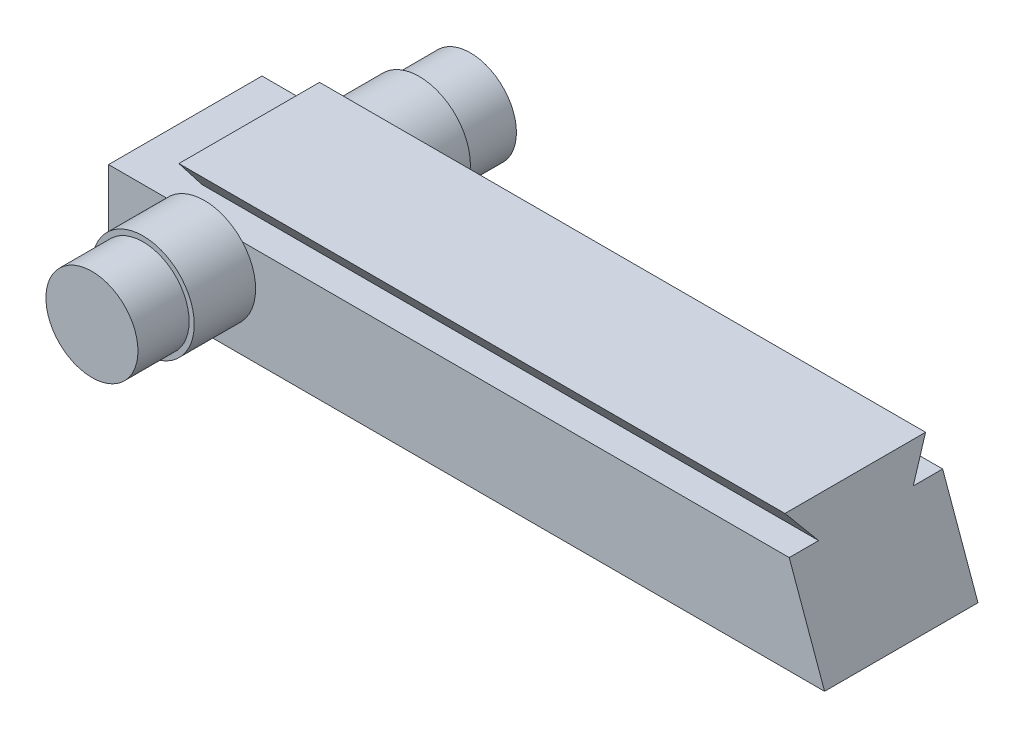
ISO-10303-21;
HEADER;
FILE_DESCRIPTION(('STEP AP214'),'2;1');
FILE_NAME('part.step','',(''),(''),'','','');
FILE_SCHEMA(('AUTOMOTIVE_DESIGN { 1 0 10303 214 1 1 1 1 }'));
ENDSEC;
DATA;
#1=APPLICATION_CONTEXT('core data for automotive mechanical design processes');
#2=APPLICATION_PROTOCOL_DEFINITION('international standard','automotive_design',2000,#1);
#3=PRODUCT_CONTEXT('',#1,'mechanical');
#4=PRODUCT('Part','Part','',(#3));
#5=PRODUCT_RELATED_PRODUCT_CATEGORY('part','',(#4));
#6=PRODUCT_DEFINITION_FORMATION('','',#4);
#7=PRODUCT_DEFINITION_CONTEXT('part definition',#1,'design');
#8=PRODUCT_DEFINITION('design','',#6,#7);
#9=PRODUCT_DEFINITION_SHAPE('','',#8);
#10=(LENGTH_UNIT() NAMED_UNIT(*) SI_UNIT(.MILLI.,.METRE.));
#11=(NAMED_UNIT(*) PLANE_ANGLE_UNIT() SI_UNIT($,.RADIAN.));
#12=(NAMED_UNIT(*) SI_UNIT($,.STERADIAN.) SOLID_ANGLE_UNIT());
#13=UNCERTAINTY_MEASURE_WITH_UNIT(LENGTH_MEASURE(1.E-05),#10,'distance_accuracy_value','');
#14=(GEOMETRIC_REPRESENTATION_CONTEXT(3) GLOBAL_UNCERTAINTY_ASSIGNED_CONTEXT((#13)) GLOBAL_UNIT_ASSIGNED_CONTEXT((#10,
#11,#12)) REPRESENTATION_CONTEXT('',''));
#15=CARTESIAN_POINT('',(0.,0.,0.));
#16=DIRECTION('',(0.,0.,1.));
#17=DIRECTION('',(1.,0.,0.));
#18=AXIS2_PLACEMENT_3D('',#15,#16,#17);
#19=CARTESIAN_POINT('',(-13.0175,0.7366,6.85800000000001));
#20=DIRECTION('',(0.,0.,1.));
#21=DIRECTION('',(1.,0.,0.));
#22=AXIS2_PLACEMENT_3D('',#19,#20,#21);
#23=PLANE('',#22);
#24=CARTESIAN_POINT('',(-13.0175,0.7366,6.85800000000001));
#25=DIRECTION('',(0.,0.,1.));
#26=DIRECTION('',(1.,0.,0.));
#27=AXIS2_PLACEMENT_3D('',#24,#25,#26);
#28=CIRCLE('',#27,2.54);
#29=CARTESIAN_POINT('',(-10.4775,0.7366,6.85800000000001));
#30=VERTEX_POINT('',#29);
#31=EDGE_CURVE('E209',#30,#30,#28,.T.);
#32=ORIENTED_EDGE('',*,*,#31,.T.);
#33=EDGE_LOOP('',(#32));
#34=FACE_BOUND('',#33,.T.);
#35=CARTESIAN_POINT('',(-13.0175,0.7366,6.85800000000001));
#36=DIRECTION('',(0.,0.,1.));
#37=DIRECTION('',(1.,0.,0.));
#38=AXIS2_PLACEMENT_3D('',#35,#36,#37);
#39=CIRCLE('',#38,2.286);
#40=CARTESIAN_POINT('',(-10.7315,0.7366,6.85800000000001));
#41=VERTEX_POINT('',#40);
#42=EDGE_CURVE('E218',#41,#41,#39,.T.);
#43=ORIENTED_EDGE('',*,*,#42,.F.);
#44=EDGE_LOOP('',(#43));
#45=FACE_BOUND('',#44,.T.);
#46=ADVANCED_FACE('F32',(#34,#45),#23,.T.);
#47=CARTESIAN_POINT('',(17.78,-2.4384,3.81000000000001));
#48=DIRECTION('',(0.,0.,-1.));
#49=DIRECTION('',(-1.,0.,0.));
#50=AXIS2_PLACEMENT_3D('',#47,#48,#49);
#51=PLANE('',#50);
#52=CARTESIAN_POINT('',(-13.0175,0.7366,3.81000000000001));
#53=DIRECTION('',(0.,0.,1.));
#54=DIRECTION('',(1.,0.,0.));
#55=AXIS2_PLACEMENT_3D('',#52,#53,#54);
#56=CIRCLE('',#55,2.54);
#57=CARTESIAN_POINT('',(-14.9030971892215,2.4384,3.81000000000001));
#58=VERTEX_POINT('',#57);
#59=CARTESIAN_POINT('',(-11.1319028107785,2.4384,3.81000000000001));
#60=VERTEX_POINT('',#59);
#61=EDGE_CURVE('E54',#58,#60,#56,.T.);
#62=ORIENTED_EDGE('',*,*,#61,.F.);
#63=DIRECTION('',(-1.,0.,0.));
#64=VECTOR('',#63,1.);
#65=CARTESIAN_POINT('',(17.78,2.4384,3.81000000000001));
#66=LINE('',#65,#64);
#67=CARTESIAN_POINT('',(-17.78,2.4384,3.81000000000001));
#68=VERTEX_POINT('',#67);
#69=EDGE_CURVE('E158',#58,#68,#66,.T.);
#70=ORIENTED_EDGE('',*,*,#69,.T.);
#71=DIRECTION('',(0.,-1.,0.));
#72=VECTOR('',#71,1.);
#73=CARTESIAN_POINT('',(-17.78,-2.4384,3.81000000000001));
#74=LINE('',#73,#72);
#75=CARTESIAN_POINT('',(-17.78,-2.4384,3.81000000000001));
#76=VERTEX_POINT('',#75);
#77=EDGE_CURVE('E152',#68,#76,#74,.T.);
#78=ORIENTED_EDGE('',*,*,#77,.T.);
#79=DIRECTION('',(-1.,0.,0.));
#80=VECTOR('',#79,1.);
#81=CARTESIAN_POINT('',(17.78,-2.4384,3.81000000000001));
#82=LINE('',#81,#80);
#83=CARTESIAN_POINT('',(17.78,-2.4384,3.81000000000001));
#84=VERTEX_POINT('',#83);
#85=EDGE_CURVE('E156',#84,#76,#82,.T.);
#86=ORIENTED_EDGE('',*,*,#85,.F.);
#87=DIRECTION('',(0.338719468272742,-0.940887411868727,0.));
#88=VECTOR('',#87,1.);
#89=CARTESIAN_POINT('',(17.78,-2.4384,3.81000000000001));
#90=LINE('',#89,#88);
#91=CARTESIAN_POINT('',(16.024352,2.4384,3.81000000000001));
#92=VERTEX_POINT('',#91);
#93=EDGE_CURVE('E207',#92,#84,#90,.T.);
#94=ORIENTED_EDGE('',*,*,#93,.F.);
#95=EDGE_CURVE('E127',#92,#60,#66,.T.);
#96=ORIENTED_EDGE('',*,*,#95,.T.);
#97=EDGE_LOOP('',(#62,#70,#78,#86,#94,#96));
#98=FACE_BOUND('',#97,.T.);
#99=ADVANCED_FACE('F239',(#98),#51,.F.);
#100=CARTESIAN_POINT('',(17.78,2.4384,3.81000000000001));
#101=DIRECTION('',(0.,-1.,0.));
#102=DIRECTION('',(0.,0.,-1.));
#103=AXIS2_PLACEMENT_3D('',#100,#101,#102);
#104=PLANE('',#103);
#105=ORIENTED_EDGE('',*,*,#95,.F.);
#106=DIRECTION('',(0.,0.,-1.));
#107=VECTOR('',#106,1.);
#108=CARTESIAN_POINT('',(16.024352,2.4384,3.81000000000001));
#109=LINE('',#108,#107);
#110=CARTESIAN_POINT('',(16.024352,2.4384,2.3495));
#111=VERTEX_POINT('',#110);
#112=EDGE_CURVE('E186',#92,#111,#109,.T.);
#113=ORIENTED_EDGE('',*,*,#112,.T.);
#114=DIRECTION('',(1.,0.,0.));
#115=VECTOR('',#114,1.);
#116=CARTESIAN_POINT('',(-14.605,2.4384,2.3495));
#117=LINE('',#116,#115);
#118=CARTESIAN_POINT('',(-14.605,2.4384,2.3495));
#119=VERTEX_POINT('',#118);
#120=EDGE_CURVE('E142',#119,#111,#117,.T.);
#121=ORIENTED_EDGE('',*,*,#120,.F.);
#122=DIRECTION('',(0.,0.,-1.));
#123=VECTOR('',#122,1.);
#124=CARTESIAN_POINT('',(-14.605,2.4384,2.3495));
#125=LINE('',#124,#123);
#126=CARTESIAN_POINT('',(-14.605,2.4384,-2.3495));
#127=VERTEX_POINT('',#126);
#128=EDGE_CURVE('E185',#119,#127,#125,.T.);
#129=ORIENTED_EDGE('',*,*,#128,.T.);
#130=DIRECTION('',(1.,0.,0.));
#131=VECTOR('',#130,1.);
#132=CARTESIAN_POINT('',(-14.605,2.4384,-2.3495));
#133=LINE('',#132,#131);
#134=CARTESIAN_POINT('',(16.024352,2.4384,-2.3495));
#135=VERTEX_POINT('',#134);
#136=EDGE_CURVE('E137',#127,#135,#133,.T.);
#137=ORIENTED_EDGE('',*,*,#136,.T.);
#138=CARTESIAN_POINT('',(16.024352,2.4384,-3.80999999999999));
#139=VERTEX_POINT('',#138);
#140=EDGE_CURVE('E180',#135,#139,#109,.T.);
#141=ORIENTED_EDGE('',*,*,#140,.T.);
#142=DIRECTION('',(-1.,0.,0.));
#143=VECTOR('',#142,1.);
#144=CARTESIAN_POINT('',(17.78,2.4384,-3.80999999999999));
#145=LINE('',#144,#143);
#146=CARTESIAN_POINT('',(-11.1319028107785,2.4384,-3.81000000000001));
#147=VERTEX_POINT('',#146);
#148=EDGE_CURVE('E129',#139,#147,#145,.T.);
#149=ORIENTED_EDGE('',*,*,#148,.T.);
#150=CARTESIAN_POINT('',(-14.9030971892215,2.4384,-3.81000000000001));
#151=VERTEX_POINT('',#150);
#152=EDGE_CURVE('E116',#147,#151,#145,.T.);
#153=ORIENTED_EDGE('',*,*,#152,.T.);
#154=CARTESIAN_POINT('',(-17.78,2.4384,-3.80999999999999));
#155=VERTEX_POINT('',#154);
#156=EDGE_CURVE('E120',#151,#155,#145,.T.);
#157=ORIENTED_EDGE('',*,*,#156,.T.);
#158=DIRECTION('',(0.,0.,1.));
#159=VECTOR('',#158,1.);
#160=CARTESIAN_POINT('',(-17.78,2.4384,3.81000000000001));
#161=LINE('',#160,#159);
#162=EDGE_CURVE('E149',#155,#68,#161,.T.);
#163=ORIENTED_EDGE('',*,*,#162,.T.);
#164=ORIENTED_EDGE('',*,*,#69,.F.);
#165=EDGE_CURVE('E164',#60,#58,#66,.T.);
#166=ORIENTED_EDGE('',*,*,#165,.F.);
#167=EDGE_LOOP('',(#105,#113,#121,#129,#137,#141,#149,#153,#157,#163,#164,#166));
#168=FACE_BOUND('',#167,.T.);
#169=ADVANCED_FACE('F131',(#168),#104,.F.);
#170=CARTESIAN_POINT('',(17.78,-2.4384,-3.80999999999999));
#171=DIRECTION('',(0.,0.,1.));
#172=DIRECTION('',(1.,0.,0.));
#173=AXIS2_PLACEMENT_3D('',#170,#171,#172);
#174=PLANE('',#173);
#175=ORIENTED_EDGE('',*,*,#156,.F.);
#176=CARTESIAN_POINT('',(-13.0175,0.7366,-3.81000000000001));
#177=DIRECTION('',(0.,0.,1.));
#178=DIRECTION('',(1.,0.,0.));
#179=AXIS2_PLACEMENT_3D('',#176,#177,#178);
#180=CIRCLE('',#179,2.54);
#181=EDGE_CURVE('E40',#151,#147,#180,.T.);
#182=ORIENTED_EDGE('',*,*,#181,.T.);
#183=ORIENTED_EDGE('',*,*,#148,.F.);
#184=DIRECTION('',(0.338719468272742,-0.940887411868727,0.));
#185=VECTOR('',#184,1.);
#186=CARTESIAN_POINT('',(17.78,-2.4384,-3.80999999999999));
#187=LINE('',#186,#185);
#188=CARTESIAN_POINT('',(17.78,-2.4384,-3.81000249999999));
#189=VERTEX_POINT('',#188);
#190=EDGE_CURVE('E176',#139,#189,#187,.T.);
#191=ORIENTED_EDGE('',*,*,#190,.T.);
#192=DIRECTION('',(-1.,0.,0.));
#193=VECTOR('',#192,1.);
#194=CARTESIAN_POINT('',(17.78,-2.4384,-3.80999999999999));
#195=LINE('',#194,#193);
#196=CARTESIAN_POINT('',(-17.78,-2.4384,-3.80999999999999));
#197=VERTEX_POINT('',#196);
#198=EDGE_CURVE('E159',#189,#197,#195,.T.);
#199=ORIENTED_EDGE('',*,*,#198,.T.);
#200=DIRECTION('',(0.,1.,0.));
#201=VECTOR('',#200,1.);
#202=CARTESIAN_POINT('',(-17.78,-2.4384,-3.80999999999999));
#203=LINE('',#202,#201);
#204=EDGE_CURVE('E123',#197,#155,#203,.T.);
#205=ORIENTED_EDGE('',*,*,#204,.T.);
#206=EDGE_LOOP('',(#175,#182,#183,#191,#199,#205));
#207=FACE_BOUND('',#206,.T.);
#208=ADVANCED_FACE('F34',(#207),#174,.F.);
#209=CARTESIAN_POINT('',(17.78,-2.4384,3.81000000000001));
#210=DIRECTION('',(0.,1.,0.));
#211=DIRECTION('',(0.,0.,1.));
#212=AXIS2_PLACEMENT_3D('',#209,#210,#211);
#213=PLANE('',#212);
#214=DIRECTION('',(0.,0.,-1.));
#215=VECTOR('',#214,1.);
#216=CARTESIAN_POINT('',(-17.78,-2.4384,3.81000000000001));
#217=LINE('',#216,#215);
#218=EDGE_CURVE('E154',#76,#197,#217,.T.);
#219=ORIENTED_EDGE('',*,*,#218,.T.);
#220=ORIENTED_EDGE('',*,*,#198,.F.);
#221=DIRECTION('',(0.,0.,-1.));
#222=VECTOR('',#221,1.);
#223=CARTESIAN_POINT('',(17.78,-2.4384,3.81000000000001));
#224=LINE('',#223,#222);
#225=EDGE_CURVE('E155',#84,#189,#224,.T.);
#226=ORIENTED_EDGE('',*,*,#225,.F.);
#227=ORIENTED_EDGE('',*,*,#85,.T.);
#228=EDGE_LOOP('',(#219,#220,#226,#227));
#229=FACE_BOUND('',#228,.T.);
#230=ADVANCED_FACE('F277',(#229),#213,.F.);
#231=CARTESIAN_POINT('',(-17.78,2.4384,-3.80999999999999));
#232=DIRECTION('',(-1.,0.,0.));
#233=DIRECTION('',(0.,0.,1.));
#234=AXIS2_PLACEMENT_3D('',#231,#232,#233);
#235=PLANE('',#234);
#236=ORIENTED_EDGE('',*,*,#204,.F.);
#237=ORIENTED_EDGE('',*,*,#218,.F.);
#238=ORIENTED_EDGE('',*,*,#77,.F.);
#239=ORIENTED_EDGE('',*,*,#162,.F.);
#240=EDGE_LOOP('',(#236,#237,#238,#239));
#241=FACE_BOUND('',#240,.T.);
#242=ADVANCED_FACE('F273',(#241),#235,.T.);
#243=CARTESIAN_POINT('',(-14.605,3.9116,3.4925));
#244=DIRECTION('',(0.,-0.612997102876588,0.790085154818713));
#245=DIRECTION('',(0.,-0.790085154818713,-0.612997102876588));
#246=AXIS2_PLACEMENT_3D('',#243,#244,#245);
#247=PLANE('',#246);
#248=DIRECTION('',(0.273579457367753,-0.759942937132647,-0.589610899499468));
#249=VECTOR('',#248,1.);
#250=CARTESIAN_POINT('',(13.2412186889611,10.1693258639969,8.34763213585969));
#251=LINE('',#250,#249);
#252=CARTESIAN_POINT('',(15.494,3.9116,3.4925));
#253=VERTEX_POINT('',#252);
#254=EDGE_CURVE('E179',#253,#111,#251,.T.);
#255=ORIENTED_EDGE('',*,*,#254,.F.);
#256=DIRECTION('',(1.,0.,0.));
#257=VECTOR('',#256,1.);
#258=CARTESIAN_POINT('',(-14.605,3.9116,3.4925));
#259=LINE('',#258,#257);
#260=CARTESIAN_POINT('',(-14.605,3.9116,3.4925));
#261=VERTEX_POINT('',#260);
#262=EDGE_CURVE('E150',#261,#253,#259,.T.);
#263=ORIENTED_EDGE('',*,*,#262,.F.);
#264=DIRECTION('',(0.,-0.790085154818713,-0.612997102876588));
#265=VECTOR('',#264,1.);
#266=CARTESIAN_POINT('',(-14.605,3.9116,3.4925));
#267=LINE('',#266,#265);
#268=EDGE_CURVE('E182',#261,#119,#267,.T.);
#269=ORIENTED_EDGE('',*,*,#268,.T.);
#270=ORIENTED_EDGE('',*,*,#120,.T.);
#271=EDGE_LOOP('',(#255,#263,#269,#270));
#272=FACE_BOUND('',#271,.T.);
#273=ADVANCED_FACE('F268',(#272),#247,.T.);
#274=CARTESIAN_POINT('',(-14.605,3.9116,3.4925));
#275=DIRECTION('',(0.,1.,0.));
#276=DIRECTION('',(0.,0.,1.));
#277=AXIS2_PLACEMENT_3D('',#274,#275,#276);
#278=PLANE('',#277);
#279=DIRECTION('',(0.,0.,1.));
#280=VECTOR('',#279,1.);
#281=CARTESIAN_POINT('',(15.494,3.9116,-3.81002499999999));
#282=LINE('',#281,#280);
#283=CARTESIAN_POINT('',(15.494,3.9116,-3.4925));
#284=VERTEX_POINT('',#283);
#285=EDGE_CURVE('E204',#284,#253,#282,.T.);
#286=ORIENTED_EDGE('',*,*,#285,.F.);
#287=DIRECTION('',(1.,0.,0.));
#288=VECTOR('',#287,1.);
#289=CARTESIAN_POINT('',(-14.605,3.9116,-3.4925));
#290=LINE('',#289,#288);
#291=CARTESIAN_POINT('',(-14.605,3.9116,-3.4925));
#292=VERTEX_POINT('',#291);
#293=EDGE_CURVE('E141',#292,#284,#290,.T.);
#294=ORIENTED_EDGE('',*,*,#293,.F.);
#295=DIRECTION('',(0.,0.,1.));
#296=VECTOR('',#295,1.);
#297=CARTESIAN_POINT('',(-14.605,3.9116,3.4925));
#298=LINE('',#297,#296);
#299=EDGE_CURVE('E192',#292,#261,#298,.T.);
#300=ORIENTED_EDGE('',*,*,#299,.T.);
#301=ORIENTED_EDGE('',*,*,#262,.T.);
#302=EDGE_LOOP('',(#286,#294,#300,#301));
#303=FACE_BOUND('',#302,.T.);
#304=ADVANCED_FACE('F203',(#303),#278,.T.);
#305=CARTESIAN_POINT('',(-14.605,3.9116,-3.4925));
#306=DIRECTION('',(0.,-0.612997102876588,-0.790085154818713));
#307=DIRECTION('',(0.,0.790085154818713,-0.612997102876588));
#308=AXIS2_PLACEMENT_3D('',#305,#306,#307);
#309=PLANE('',#308);
#310=DIRECTION('',(-0.273579457367753,0.759942937132647,-0.589610899499468));
#311=VECTOR('',#310,1.);
#312=CARTESIAN_POINT('',(13.2412186889611,10.1693258639969,-8.34763213585969));
#313=LINE('',#312,#311);
#314=EDGE_CURVE('E133',#135,#284,#313,.T.);
#315=ORIENTED_EDGE('',*,*,#314,.F.);
#316=ORIENTED_EDGE('',*,*,#136,.F.);
#317=DIRECTION('',(0.,0.790085154818713,-0.612997102876588));
#318=VECTOR('',#317,1.);
#319=CARTESIAN_POINT('',(-14.605,3.9116,-3.4925));
#320=LINE('',#319,#318);
#321=EDGE_CURVE('E189',#127,#292,#320,.T.);
#322=ORIENTED_EDGE('',*,*,#321,.T.);
#323=ORIENTED_EDGE('',*,*,#293,.T.);
#324=EDGE_LOOP('',(#315,#316,#322,#323));
#325=FACE_BOUND('',#324,.T.);
#326=ADVANCED_FACE('F200',(#325),#309,.T.);
#327=CARTESIAN_POINT('',(-14.605,-0.589844444444443,0.));
#328=DIRECTION('',(-1.,0.,0.));
#329=DIRECTION('',(0.,0.,1.));
#330=AXIS2_PLACEMENT_3D('',#327,#328,#329);
#331=PLANE('',#330);
#332=ORIENTED_EDGE('',*,*,#268,.F.);
#333=ORIENTED_EDGE('',*,*,#299,.F.);
#334=ORIENTED_EDGE('',*,*,#321,.F.);
#335=ORIENTED_EDGE('',*,*,#128,.F.);
#336=EDGE_LOOP('',(#332,#333,#334,#335));
#337=FACE_BOUND('',#336,.T.);
#338=ADVANCED_FACE('F262',(#337),#331,.T.);
#339=CARTESIAN_POINT('',(17.78,-2.4384,-3.81002499999999));
#340=DIRECTION('',(-0.940887411868727,-0.338719468272742,0.));
#341=DIRECTION('',(0.338719468272742,-0.940887411868727,0.));
#342=AXIS2_PLACEMENT_3D('',#339,#340,#341);
#343=PLANE('',#342);
#344=ORIENTED_EDGE('',*,*,#93,.T.);
#345=ORIENTED_EDGE('',*,*,#225,.T.);
#346=ORIENTED_EDGE('',*,*,#190,.F.);
#347=ORIENTED_EDGE('',*,*,#140,.F.);
#348=ORIENTED_EDGE('',*,*,#314,.T.);
#349=ORIENTED_EDGE('',*,*,#285,.T.);
#350=ORIENTED_EDGE('',*,*,#254,.T.);
#351=ORIENTED_EDGE('',*,*,#112,.F.);
#352=EDGE_LOOP('',(#344,#345,#346,#347,#348,#349,#350,#351));
#353=FACE_BOUND('',#352,.T.);
#354=ADVANCED_FACE('F255',(#353),#343,.F.);
#355=CARTESIAN_POINT('',(-13.0175,0.7366,3.81000000000001));
#356=DIRECTION('',(0.,0.,1.));
#357=DIRECTION('',(1.,0.,0.));
#358=AXIS2_PLACEMENT_3D('',#355,#356,#357);
#359=PLANE('',#358);
#360=EDGE_CURVE('E212',#60,#58,#56,.T.);
#361=ORIENTED_EDGE('',*,*,#360,.F.);
#362=ORIENTED_EDGE('',*,*,#165,.T.);
#363=EDGE_LOOP('',(#361,#362));
#364=FACE_BOUND('',#363,.T.);
#365=ADVANCED_FACE('F251',(#364),#359,.F.);
#366=CARTESIAN_POINT('',(-13.0175,0.7366,6.85800000000001));
#367=DIRECTION('',(0.,0.,-1.));
#368=DIRECTION('',(-1.,0.,0.));
#369=AXIS2_PLACEMENT_3D('',#366,#367,#368);
#370=CYLINDRICAL_SURFACE('',#369,2.54);
#371=ORIENTED_EDGE('',*,*,#31,.F.);
#372=EDGE_LOOP('',(#371));
#373=FACE_BOUND('',#372,.T.);
#374=ORIENTED_EDGE('',*,*,#360,.T.);
#375=ORIENTED_EDGE('',*,*,#61,.T.);
#376=EDGE_LOOP('',(#374,#375));
#377=FACE_BOUND('',#376,.T.);
#378=ADVANCED_FACE('F254',(#373,#377),#370,.T.);
#379=CARTESIAN_POINT('',(-13.0175,0.7366,9.39800000000001));
#380=DIRECTION('',(0.,0.,-1.));
#381=DIRECTION('',(-1.,0.,0.));
#382=AXIS2_PLACEMENT_3D('',#379,#380,#381);
#383=CYLINDRICAL_SURFACE('',#382,2.286);
#384=CARTESIAN_POINT('',(-13.0175,0.7366,9.39800000000001));
#385=DIRECTION('',(0.,0.,1.));
#386=DIRECTION('',(1.,0.,0.));
#387=AXIS2_PLACEMENT_3D('',#384,#385,#386);
#388=CIRCLE('',#387,2.286);
#389=CARTESIAN_POINT('',(-10.7315,0.7366,9.39800000000001));
#390=VERTEX_POINT('',#389);
#391=EDGE_CURVE('E215',#390,#390,#388,.T.);
#392=ORIENTED_EDGE('',*,*,#391,.F.);
#393=EDGE_LOOP('',(#392));
#394=FACE_BOUND('',#393,.T.);
#395=ORIENTED_EDGE('',*,*,#42,.T.);
#396=EDGE_LOOP('',(#395));
#397=FACE_BOUND('',#396,.T.);
#398=ADVANCED_FACE('F249',(#394,#397),#383,.T.);
#399=CARTESIAN_POINT('',(-13.0175,0.7366,9.39800000000001));
#400=DIRECTION('',(0.,0.,1.));
#401=DIRECTION('',(1.,0.,0.));
#402=AXIS2_PLACEMENT_3D('',#399,#400,#401);
#403=PLANE('',#402);
#404=ORIENTED_EDGE('',*,*,#391,.T.);
#405=EDGE_LOOP('',(#404));
#406=FACE_BOUND('',#405,.T.);
#407=ADVANCED_FACE('F330',(#406),#403,.T.);
#408=CARTESIAN_POINT('',(-13.0175,0.7366,-6.85800000000001));
#409=DIRECTION('',(0.,0.,1.));
#410=DIRECTION('',(1.,0.,0.));
#411=AXIS2_PLACEMENT_3D('',#408,#409,#410);
#412=CYLINDRICAL_SURFACE('',#411,2.54);
#413=CARTESIAN_POINT('',(-13.0175,0.7366,-6.85800000000001));
#414=DIRECTION('',(0.,0.,1.));
#415=DIRECTION('',(1.,0.,0.));
#416=AXIS2_PLACEMENT_3D('',#413,#414,#415);
#417=CIRCLE('',#416,2.54);
#418=CARTESIAN_POINT('',(-10.4775,0.7366,-6.85800000000001));
#419=VERTEX_POINT('',#418);
#420=EDGE_CURVE('E117',#419,#419,#417,.T.);
#421=ORIENTED_EDGE('',*,*,#420,.T.);
#422=EDGE_LOOP('',(#421));
#423=FACE_BOUND('',#422,.T.);
#424=EDGE_CURVE('E46',#147,#151,#180,.T.);
#425=ORIENTED_EDGE('',*,*,#424,.F.);
#426=ORIENTED_EDGE('',*,*,#181,.F.);
#427=EDGE_LOOP('',(#425,#426));
#428=FACE_BOUND('',#427,.T.);
#429=ADVANCED_FACE('F107',(#423,#428),#412,.T.);
#430=CARTESIAN_POINT('',(-13.0175,0.7366,-6.85800000000001));
#431=DIRECTION('',(0.,0.,-1.));
#432=DIRECTION('',(1.,0.,0.));
#433=AXIS2_PLACEMENT_3D('',#430,#431,#432);
#434=PLANE('',#433);
#435=CARTESIAN_POINT('',(-13.0175,0.7366,-6.85800000000001));
#436=DIRECTION('',(0.,0.,-1.));
#437=DIRECTION('',(-1.,0.,0.));
#438=AXIS2_PLACEMENT_3D('',#435,#436,#437);
#439=CIRCLE('',#438,2.286);
#440=CARTESIAN_POINT('',(-15.3035,0.7366,-6.85800000000001));
#441=VERTEX_POINT('',#440);
#442=EDGE_CURVE('E11',#441,#441,#439,.T.);
#443=ORIENTED_EDGE('',*,*,#442,.F.);
#444=EDGE_LOOP('',(#443));
#445=FACE_BOUND('',#444,.T.);
#446=ORIENTED_EDGE('',*,*,#420,.F.);
#447=EDGE_LOOP('',(#446));
#448=FACE_BOUND('',#447,.T.);
#449=ADVANCED_FACE('F342',(#445,#448),#434,.T.);
#450=CARTESIAN_POINT('',(-13.0175,0.7366,-3.81000000000001));
#451=DIRECTION('',(0.,0.,-1.));
#452=DIRECTION('',(1.,0.,0.));
#453=AXIS2_PLACEMENT_3D('',#450,#451,#452);
#454=PLANE('',#453);
#455=ORIENTED_EDGE('',*,*,#152,.F.);
#456=ORIENTED_EDGE('',*,*,#424,.T.);
#457=EDGE_LOOP('',(#455,#456));
#458=FACE_BOUND('',#457,.T.);
#459=ADVANCED_FACE('F114',(#458),#454,.F.);
#460=CARTESIAN_POINT('',(-13.0175,0.7366,-9.39800000000001));
#461=DIRECTION('',(0.,0.,1.));
#462=DIRECTION('',(1.,0.,0.));
#463=AXIS2_PLACEMENT_3D('',#460,#461,#462);
#464=CYLINDRICAL_SURFACE('',#463,2.286);
#465=CARTESIAN_POINT('',(-13.0175,0.7366,-9.39800000000001));
#466=DIRECTION('',(0.,0.,1.));
#467=DIRECTION('',(1.,0.,0.));
#468=AXIS2_PLACEMENT_3D('',#465,#466,#467);
#469=CIRCLE('',#468,2.286);
#470=CARTESIAN_POINT('',(-10.7315,0.7366,-9.39800000000001));
#471=VERTEX_POINT('',#470);
#472=EDGE_CURVE('E118',#471,#471,#469,.T.);
#473=ORIENTED_EDGE('',*,*,#472,.T.);
#474=EDGE_LOOP('',(#473));
#475=FACE_BOUND('',#474,.T.);
#476=ORIENTED_EDGE('',*,*,#442,.T.);
#477=EDGE_LOOP('',(#476));
#478=FACE_BOUND('',#477,.T.);
#479=ADVANCED_FACE('F228',(#475,#478),#464,.T.);
#480=CARTESIAN_POINT('',(-13.0175,0.7366,-9.39800000000001));
#481=DIRECTION('',(0.,0.,-1.));
#482=DIRECTION('',(1.,0.,0.));
#483=AXIS2_PLACEMENT_3D('',#480,#481,#482);
#484=PLANE('',#483);
#485=ORIENTED_EDGE('',*,*,#472,.F.);
#486=EDGE_LOOP('',(#485));
#487=FACE_BOUND('',#486,.T.);
#488=ADVANCED_FACE('F231',(#487),#484,.T.);
#489=CLOSED_SHELL('',(#46,#99,#169,#208,#230,#242,#273,#304,#326,#338,#354,#365,#378,#398,#407,
#429,#449,#459,#479,#488));
#490=MANIFOLD_SOLID_BREP('B2',#489);
#491=ADVANCED_BREP_SHAPE_REPRESENTATION('',(#18,#490),#14);
#492=SHAPE_DEFINITION_REPRESENTATION(#9,#491);
ENDSEC;
END-ISO-10303-21;
